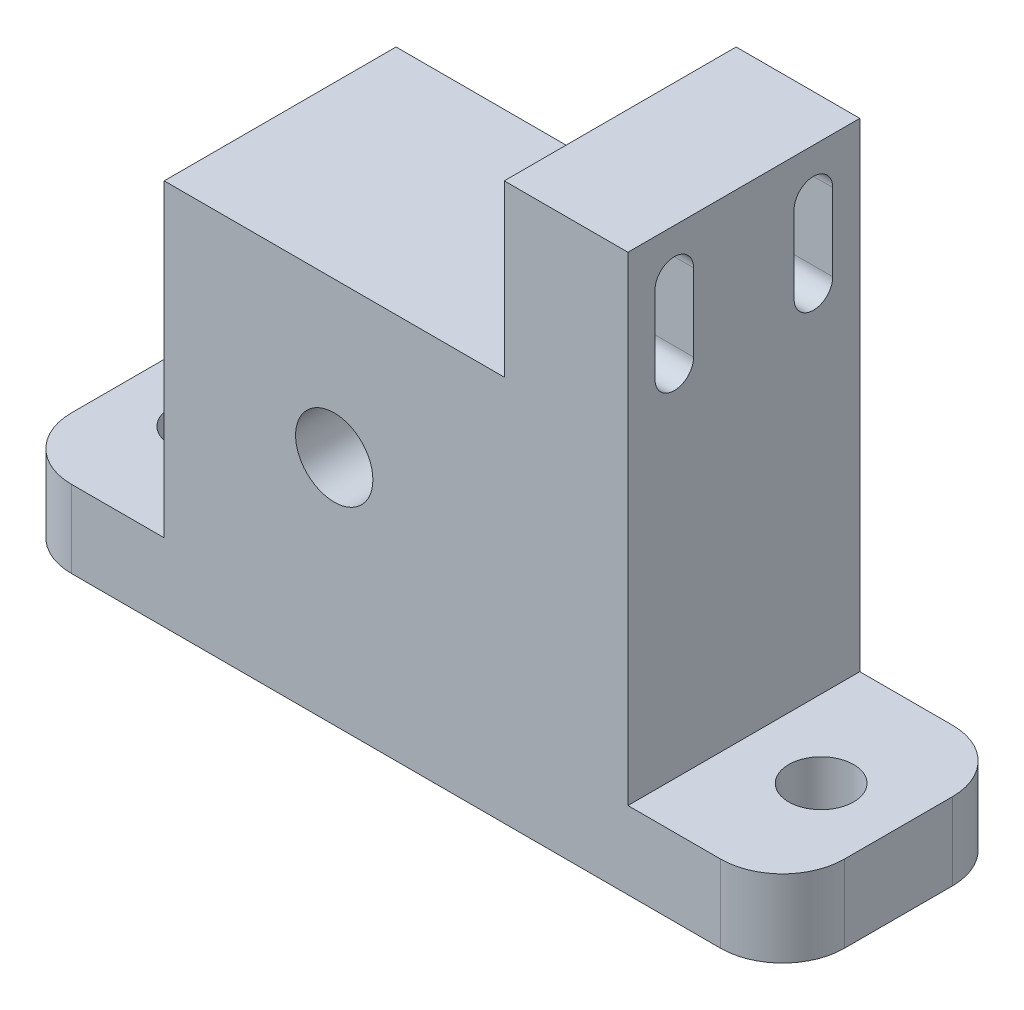
ISO-10303-21;
HEADER;
FILE_DESCRIPTION(('STEP AP214'),'2;1');
FILE_NAME('part.step','',(''),(''),'','','');
FILE_SCHEMA(('AUTOMOTIVE_DESIGN { 1 0 10303 214 1 1 1 1 }'));
ENDSEC;
DATA;
#1=APPLICATION_CONTEXT('core data for automotive mechanical design processes');
#2=APPLICATION_PROTOCOL_DEFINITION('international standard','automotive_design',2000,#1);
#3=PRODUCT_CONTEXT('',#1,'mechanical');
#4=PRODUCT('Part','Part','',(#3));
#5=PRODUCT_RELATED_PRODUCT_CATEGORY('part','',(#4));
#6=PRODUCT_DEFINITION_FORMATION('','',#4);
#7=PRODUCT_DEFINITION_CONTEXT('part definition',#1,'design');
#8=PRODUCT_DEFINITION('design','',#6,#7);
#9=PRODUCT_DEFINITION_SHAPE('','',#8);
#10=(LENGTH_UNIT() NAMED_UNIT(*) SI_UNIT(.MILLI.,.METRE.));
#11=(NAMED_UNIT(*) PLANE_ANGLE_UNIT() SI_UNIT($,.RADIAN.));
#12=(NAMED_UNIT(*) SI_UNIT($,.STERADIAN.) SOLID_ANGLE_UNIT());
#13=UNCERTAINTY_MEASURE_WITH_UNIT(LENGTH_MEASURE(1.E-05),#10,'distance_accuracy_value','');
#14=(GEOMETRIC_REPRESENTATION_CONTEXT(3) GLOBAL_UNCERTAINTY_ASSIGNED_CONTEXT((#13)) GLOBAL_UNIT_ASSIGNED_CONTEXT((#10,
#11,#12)) REPRESENTATION_CONTEXT('',''));
#15=CARTESIAN_POINT('',(0.,0.,0.));
#16=DIRECTION('',(0.,0.,1.));
#17=DIRECTION('',(1.,0.,0.));
#18=AXIS2_PLACEMENT_3D('',#15,#16,#17);
#19=CARTESIAN_POINT('',(15.,25.,-7.5));
#20=DIRECTION('',(-1.,0.,0.));
#21=DIRECTION('',(0.,0.,1.));
#22=AXIS2_PLACEMENT_3D('',#19,#20,#21);
#23=PLANE('',#22);
#24=DIRECTION('',(0.,-1.,0.));
#25=VECTOR('',#24,1.);
#26=CARTESIAN_POINT('',(15.,33.,5.75));
#27=LINE('',#26,#25);
#28=CARTESIAN_POINT('',(15.,33.,5.75));
#29=VERTEX_POINT('',#28);
#30=CARTESIAN_POINT('',(15.,28.,5.75));
#31=VERTEX_POINT('',#30);
#32=EDGE_CURVE('E209',#29,#31,#27,.T.);
#33=ORIENTED_EDGE('',*,*,#32,.F.);
#34=CARTESIAN_POINT('',(15.,33.,4.5));
#35=DIRECTION('',(-1.,0.,0.));
#36=DIRECTION('',(0.,0.,1.));
#37=AXIS2_PLACEMENT_3D('',#34,#35,#36);
#38=CIRCLE('',#37,1.25);
#39=CARTESIAN_POINT('',(15.,33.,3.25));
#40=VERTEX_POINT('',#39);
#41=EDGE_CURVE('E188',#40,#29,#38,.F.);
#42=ORIENTED_EDGE('',*,*,#41,.F.);
#43=DIRECTION('',(0.,1.,0.));
#44=VECTOR('',#43,1.);
#45=CARTESIAN_POINT('',(15.,33.,3.25));
#46=LINE('',#45,#44);
#47=CARTESIAN_POINT('',(15.,28.,3.25));
#48=VERTEX_POINT('',#47);
#49=EDGE_CURVE('E200',#48,#40,#46,.T.);
#50=ORIENTED_EDGE('',*,*,#49,.F.);
#51=CARTESIAN_POINT('',(15.,28.,4.5));
#52=DIRECTION('',(-1.,0.,0.));
#53=DIRECTION('',(0.,0.,1.));
#54=AXIS2_PLACEMENT_3D('',#51,#52,#53);
#55=CIRCLE('',#54,1.25);
#56=EDGE_CURVE('E213',#31,#48,#55,.F.);
#57=ORIENTED_EDGE('',*,*,#56,.F.);
#58=EDGE_LOOP('',(#33,#42,#50,#57));
#59=FACE_BOUND('',#58,.T.);
#60=DIRECTION('',(0.,-1.,0.));
#61=VECTOR('',#60,1.);
#62=CARTESIAN_POINT('',(15.,33.,-3.25));
#63=LINE('',#62,#61);
#64=CARTESIAN_POINT('',(15.,33.,-3.25));
#65=VERTEX_POINT('',#64);
#66=CARTESIAN_POINT('',(15.,28.,-3.25));
#67=VERTEX_POINT('',#66);
#68=EDGE_CURVE('E229',#65,#67,#63,.T.);
#69=ORIENTED_EDGE('',*,*,#68,.F.);
#70=CARTESIAN_POINT('',(15.,33.,-4.5));
#71=DIRECTION('',(-1.,0.,0.));
#72=DIRECTION('',(0.,0.,1.));
#73=AXIS2_PLACEMENT_3D('',#70,#71,#72);
#74=CIRCLE('',#73,1.25);
#75=CARTESIAN_POINT('',(15.,33.,-5.75));
#76=VERTEX_POINT('',#75);
#77=EDGE_CURVE('E233',#76,#65,#74,.F.);
#78=ORIENTED_EDGE('',*,*,#77,.F.);
#79=DIRECTION('',(0.,1.,0.));
#80=VECTOR('',#79,1.);
#81=CARTESIAN_POINT('',(15.,33.,-5.75));
#82=LINE('',#81,#80);
#83=CARTESIAN_POINT('',(15.,28.,-5.75));
#84=VERTEX_POINT('',#83);
#85=EDGE_CURVE('E250',#84,#76,#82,.T.);
#86=ORIENTED_EDGE('',*,*,#85,.F.);
#87=CARTESIAN_POINT('',(15.,28.,-4.5));
#88=DIRECTION('',(-1.,0.,0.));
#89=DIRECTION('',(0.,0.,1.));
#90=AXIS2_PLACEMENT_3D('',#87,#88,#89);
#91=CIRCLE('',#90,1.25);
#92=EDGE_CURVE('E227',#67,#84,#91,.F.);
#93=ORIENTED_EDGE('',*,*,#92,.F.);
#94=EDGE_LOOP('',(#69,#78,#86,#93));
#95=FACE_BOUND('',#94,.T.);
#96=DIRECTION('',(0.,-1.,0.));
#97=VECTOR('',#96,1.);
#98=CARTESIAN_POINT('',(15.,25.,7.5));
#99=LINE('',#98,#97);
#100=CARTESIAN_POINT('',(15.,36.,7.5));
#101=VERTEX_POINT('',#100);
#102=CARTESIAN_POINT('',(15.,5.,7.5));
#103=VERTEX_POINT('',#102);
#104=EDGE_CURVE('E291',#101,#103,#99,.T.);
#105=ORIENTED_EDGE('',*,*,#104,.T.);
#106=DIRECTION('',(0.,0.,-1.));
#107=VECTOR('',#106,1.);
#108=CARTESIAN_POINT('',(15.,5.,-7.5));
#109=LINE('',#108,#107);
#110=CARTESIAN_POINT('',(15.,5.,-7.5));
#111=VERTEX_POINT('',#110);
#112=EDGE_CURVE('E230',#103,#111,#109,.T.);
#113=ORIENTED_EDGE('',*,*,#112,.T.);
#114=DIRECTION('',(0.,-1.,0.));
#115=VECTOR('',#114,1.);
#116=CARTESIAN_POINT('',(15.,25.,-7.5));
#117=LINE('',#116,#115);
#118=CARTESIAN_POINT('',(15.,36.,-7.5));
#119=VERTEX_POINT('',#118);
#120=EDGE_CURVE('E304',#119,#111,#117,.T.);
#121=ORIENTED_EDGE('',*,*,#120,.F.);
#122=DIRECTION('',(0.,0.,-1.));
#123=VECTOR('',#122,1.);
#124=CARTESIAN_POINT('',(15.,36.,-7.5));
#125=LINE('',#124,#123);
#126=EDGE_CURVE('E265',#101,#119,#125,.T.);
#127=ORIENTED_EDGE('',*,*,#126,.F.);
#128=EDGE_LOOP('',(#105,#113,#121,#127));
#129=FACE_BOUND('',#128,.T.);
#130=ADVANCED_FACE('F35',(#59,#95,#129),#23,.F.);
#131=CARTESIAN_POINT('',(-15.,25.,-7.5));
#132=DIRECTION('',(0.,0.,1.));
#133=DIRECTION('',(1.,0.,0.));
#134=AXIS2_PLACEMENT_3D('',#131,#132,#133);
#135=PLANE('',#134);
#136=CARTESIAN_POINT('',(-4.,15.,-7.5));
#137=DIRECTION('',(0.,0.,1.));
#138=DIRECTION('',(1.,0.,0.));
#139=AXIS2_PLACEMENT_3D('',#136,#137,#138);
#140=CIRCLE('',#139,2.5);
#141=CARTESIAN_POINT('',(-1.5,15.,-7.5));
#142=VERTEX_POINT('',#141);
#143=EDGE_CURVE('E261',#142,#142,#140,.F.);
#144=ORIENTED_EDGE('',*,*,#143,.F.);
#145=EDGE_LOOP('',(#144));
#146=FACE_BOUND('',#145,.T.);
#147=DIRECTION('',(1.,0.,0.));
#148=VECTOR('',#147,1.);
#149=CARTESIAN_POINT('',(-25.,5.,-7.5));
#150=LINE('',#149,#148);
#151=CARTESIAN_POINT('',(21.,5.,-7.5));
#152=VERTEX_POINT('',#151);
#153=EDGE_CURVE('E409',#111,#152,#150,.T.);
#154=ORIENTED_EDGE('',*,*,#153,.T.);
#155=DIRECTION('',(0.,-1.,0.));
#156=VECTOR('',#155,1.);
#157=CARTESIAN_POINT('',(21.,0.,-7.5));
#158=LINE('',#157,#156);
#159=CARTESIAN_POINT('',(21.,0.,-7.5));
#160=VERTEX_POINT('',#159);
#161=EDGE_CURVE('E331',#152,#160,#158,.T.);
#162=ORIENTED_EDGE('',*,*,#161,.T.);
#163=DIRECTION('',(-1.,0.,0.));
#164=VECTOR('',#163,1.);
#165=CARTESIAN_POINT('',(-15.,0.,-7.5));
#166=LINE('',#165,#164);
#167=CARTESIAN_POINT('',(-21.,0.,-7.5));
#168=VERTEX_POINT('',#167);
#169=EDGE_CURVE('E283',#160,#168,#166,.T.);
#170=ORIENTED_EDGE('',*,*,#169,.T.);
#171=DIRECTION('',(0.,-1.,0.));
#172=VECTOR('',#171,1.);
#173=CARTESIAN_POINT('',(-21.,5.,-7.5));
#174=LINE('',#173,#172);
#175=CARTESIAN_POINT('',(-21.,5.,-7.5));
#176=VERTEX_POINT('',#175);
#177=EDGE_CURVE('E329',#168,#176,#174,.F.);
#178=ORIENTED_EDGE('',*,*,#177,.T.);
#179=CARTESIAN_POINT('',(-15.,5.,-7.5));
#180=VERTEX_POINT('',#179);
#181=EDGE_CURVE('E372',#176,#180,#150,.T.);
#182=ORIENTED_EDGE('',*,*,#181,.T.);
#183=DIRECTION('',(0.,-1.,0.));
#184=VECTOR('',#183,1.);
#185=CARTESIAN_POINT('',(-15.,25.,-7.5));
#186=LINE('',#185,#184);
#187=CARTESIAN_POINT('',(-15.,25.,-7.5));
#188=VERTEX_POINT('',#187);
#189=EDGE_CURVE('E301',#188,#180,#186,.T.);
#190=ORIENTED_EDGE('',*,*,#189,.F.);
#191=DIRECTION('',(-1.,0.,0.));
#192=VECTOR('',#191,1.);
#193=CARTESIAN_POINT('',(-15.,25.,-7.5));
#194=LINE('',#193,#192);
#195=CARTESIAN_POINT('',(7.,25.,-7.5));
#196=VERTEX_POINT('',#195);
#197=EDGE_CURVE('E284',#196,#188,#194,.T.);
#198=ORIENTED_EDGE('',*,*,#197,.F.);
#199=DIRECTION('',(0.,-1.,0.));
#200=VECTOR('',#199,1.);
#201=CARTESIAN_POINT('',(6.99999999999999,36.,-7.5));
#202=LINE('',#201,#200);
#203=CARTESIAN_POINT('',(6.99999999999999,36.,-7.5));
#204=VERTEX_POINT('',#203);
#205=EDGE_CURVE('E280',#204,#196,#202,.T.);
#206=ORIENTED_EDGE('',*,*,#205,.F.);
#207=DIRECTION('',(-1.,0.,0.));
#208=VECTOR('',#207,1.);
#209=CARTESIAN_POINT('',(15.,36.,-7.5));
#210=LINE('',#209,#208);
#211=EDGE_CURVE('E268',#119,#204,#210,.T.);
#212=ORIENTED_EDGE('',*,*,#211,.F.);
#213=ORIENTED_EDGE('',*,*,#120,.T.);
#214=EDGE_LOOP('',(#154,#162,#170,#178,#182,#190,#198,#206,#212,#213));
#215=FACE_BOUND('',#214,.T.);
#216=ADVANCED_FACE('F403',(#146,#215),#135,.F.);
#217=CARTESIAN_POINT('',(-15.,25.,-7.5));
#218=DIRECTION('',(1.,0.,0.));
#219=DIRECTION('',(0.,0.,-1.));
#220=AXIS2_PLACEMENT_3D('',#217,#218,#219);
#221=PLANE('',#220);
#222=ORIENTED_EDGE('',*,*,#189,.T.);
#223=DIRECTION('',(0.,0.,1.));
#224=VECTOR('',#223,1.);
#225=CARTESIAN_POINT('',(-15.,5.,-7.5));
#226=LINE('',#225,#224);
#227=CARTESIAN_POINT('',(-15.,5.,7.5));
#228=VERTEX_POINT('',#227);
#229=EDGE_CURVE('E370',#180,#228,#226,.T.);
#230=ORIENTED_EDGE('',*,*,#229,.T.);
#231=DIRECTION('',(0.,-1.,0.));
#232=VECTOR('',#231,1.);
#233=CARTESIAN_POINT('',(-15.,25.,7.5));
#234=LINE('',#233,#232);
#235=CARTESIAN_POINT('',(-15.,25.,7.5));
#236=VERTEX_POINT('',#235);
#237=EDGE_CURVE('E298',#236,#228,#234,.T.);
#238=ORIENTED_EDGE('',*,*,#237,.F.);
#239=DIRECTION('',(0.,0.,1.));
#240=VECTOR('',#239,1.);
#241=CARTESIAN_POINT('',(-15.,25.,-7.5));
#242=LINE('',#241,#240);
#243=EDGE_CURVE('E286',#188,#236,#242,.T.);
#244=ORIENTED_EDGE('',*,*,#243,.F.);
#245=EDGE_LOOP('',(#222,#230,#238,#244));
#246=FACE_BOUND('',#245,.T.);
#247=ADVANCED_FACE('F408',(#246),#221,.F.);
#248=CARTESIAN_POINT('',(-15.,25.,7.5));
#249=DIRECTION('',(0.,0.,-1.));
#250=DIRECTION('',(-1.,0.,0.));
#251=AXIS2_PLACEMENT_3D('',#248,#249,#250);
#252=PLANE('',#251);
#253=CARTESIAN_POINT('',(-4.,15.,7.5));
#254=DIRECTION('',(0.,0.,1.));
#255=DIRECTION('',(1.,0.,0.));
#256=AXIS2_PLACEMENT_3D('',#253,#254,#255);
#257=CIRCLE('',#256,2.5);
#258=CARTESIAN_POINT('',(-1.5,15.,7.5));
#259=VERTEX_POINT('',#258);
#260=EDGE_CURVE('E204',#259,#259,#257,.T.);
#261=ORIENTED_EDGE('',*,*,#260,.F.);
#262=EDGE_LOOP('',(#261));
#263=FACE_BOUND('',#262,.T.);
#264=DIRECTION('',(1.,0.,0.));
#265=VECTOR('',#264,1.);
#266=CARTESIAN_POINT('',(-15.,0.,7.5));
#267=LINE('',#266,#265);
#268=CARTESIAN_POINT('',(-21.,0.,7.5));
#269=VERTEX_POINT('',#268);
#270=CARTESIAN_POINT('',(21.,0.,7.5));
#271=VERTEX_POINT('',#270);
#272=EDGE_CURVE('E287',#269,#271,#267,.T.);
#273=ORIENTED_EDGE('',*,*,#272,.T.);
#274=DIRECTION('',(0.,-1.,0.));
#275=VECTOR('',#274,1.);
#276=CARTESIAN_POINT('',(21.,5.,7.5));
#277=LINE('',#276,#275);
#278=CARTESIAN_POINT('',(21.,5.,7.5));
#279=VERTEX_POINT('',#278);
#280=EDGE_CURVE('E323',#271,#279,#277,.F.);
#281=ORIENTED_EDGE('',*,*,#280,.T.);
#282=DIRECTION('',(-1.,0.,0.));
#283=VECTOR('',#282,1.);
#284=CARTESIAN_POINT('',(-25.,5.,7.5));
#285=LINE('',#284,#283);
#286=EDGE_CURVE('E351',#279,#103,#285,.T.);
#287=ORIENTED_EDGE('',*,*,#286,.T.);
#288=ORIENTED_EDGE('',*,*,#104,.F.);
#289=DIRECTION('',(1.,0.,0.));
#290=VECTOR('',#289,1.);
#291=CARTESIAN_POINT('',(15.,36.,7.5));
#292=LINE('',#291,#290);
#293=CARTESIAN_POINT('',(7.,36.,7.5));
#294=VERTEX_POINT('',#293);
#295=EDGE_CURVE('E272',#294,#101,#292,.T.);
#296=ORIENTED_EDGE('',*,*,#295,.F.);
#297=DIRECTION('',(0.,-1.,0.));
#298=VECTOR('',#297,1.);
#299=CARTESIAN_POINT('',(7.,36.,7.5));
#300=LINE('',#299,#298);
#301=CARTESIAN_POINT('',(7.,25.,7.5));
#302=VERTEX_POINT('',#301);
#303=EDGE_CURVE('E275',#294,#302,#300,.T.);
#304=ORIENTED_EDGE('',*,*,#303,.T.);
#305=DIRECTION('',(1.,0.,0.));
#306=VECTOR('',#305,1.);
#307=CARTESIAN_POINT('',(-15.,25.,7.5));
#308=LINE('',#307,#306);
#309=EDGE_CURVE('E289',#236,#302,#308,.T.);
#310=ORIENTED_EDGE('',*,*,#309,.F.);
#311=ORIENTED_EDGE('',*,*,#237,.T.);
#312=CARTESIAN_POINT('',(-21.,5.,7.5));
#313=VERTEX_POINT('',#312);
#314=EDGE_CURVE('E342',#228,#313,#285,.T.);
#315=ORIENTED_EDGE('',*,*,#314,.T.);
#316=DIRECTION('',(0.,-1.,0.));
#317=VECTOR('',#316,1.);
#318=CARTESIAN_POINT('',(-21.,0.,7.5));
#319=LINE('',#318,#317);
#320=EDGE_CURVE('E320',#313,#269,#319,.T.);
#321=ORIENTED_EDGE('',*,*,#320,.T.);
#322=EDGE_LOOP('',(#273,#281,#287,#288,#296,#304,#310,#311,#315,#321));
#323=FACE_BOUND('',#322,.T.);
#324=ADVANCED_FACE('F347',(#263,#323),#252,.F.);
#325=CARTESIAN_POINT('',(0.,25.,0.));
#326=DIRECTION('',(0.,1.,0.));
#327=DIRECTION('',(0.,0.,1.));
#328=AXIS2_PLACEMENT_3D('',#325,#326,#327);
#329=PLANE('',#328);
#330=DIRECTION('',(0.,0.,1.));
#331=VECTOR('',#330,1.);
#332=CARTESIAN_POINT('',(6.99999999999999,25.,-7.5));
#333=LINE('',#332,#331);
#334=EDGE_CURVE('E264',#196,#302,#333,.T.);
#335=ORIENTED_EDGE('',*,*,#334,.F.);
#336=ORIENTED_EDGE('',*,*,#197,.T.);
#337=ORIENTED_EDGE('',*,*,#243,.T.);
#338=ORIENTED_EDGE('',*,*,#309,.T.);
#339=EDGE_LOOP('',(#335,#336,#337,#338));
#340=FACE_BOUND('',#339,.T.);
#341=ADVANCED_FACE('F406',(#340),#329,.T.);
#342=CARTESIAN_POINT('',(0.,0.,0.));
#343=DIRECTION('',(0.,1.,0.));
#344=DIRECTION('',(0.,0.,1.));
#345=AXIS2_PLACEMENT_3D('',#342,#343,#344);
#346=PLANE('',#345);
#347=DIRECTION('',(0.,0.,1.));
#348=VECTOR('',#347,1.);
#349=CARTESIAN_POINT('',(25.,0.,-7.5));
#350=LINE('',#349,#348);
#351=CARTESIAN_POINT('',(25.,0.,-3.5));
#352=VERTEX_POINT('',#351);
#353=CARTESIAN_POINT('',(25.,0.,3.5));
#354=VERTEX_POINT('',#353);
#355=EDGE_CURVE('E362',#352,#354,#350,.T.);
#356=ORIENTED_EDGE('',*,*,#355,.T.);
#357=CARTESIAN_POINT('',(21.,0.,3.5));
#358=DIRECTION('',(0.,1.,0.));
#359=DIRECTION('',(0.,0.,1.));
#360=AXIS2_PLACEMENT_3D('',#357,#358,#359);
#361=CIRCLE('',#360,4.);
#362=EDGE_CURVE('E318',#354,#271,#361,.F.);
#363=ORIENTED_EDGE('',*,*,#362,.T.);
#364=ORIENTED_EDGE('',*,*,#272,.F.);
#365=CARTESIAN_POINT('',(-21.,0.,3.5));
#366=DIRECTION('',(0.,1.,0.));
#367=DIRECTION('',(0.,0.,1.));
#368=AXIS2_PLACEMENT_3D('',#365,#366,#367);
#369=CIRCLE('',#368,4.);
#370=CARTESIAN_POINT('',(-25.,0.,3.5));
#371=VERTEX_POINT('',#370);
#372=EDGE_CURVE('E312',#269,#371,#369,.F.);
#373=ORIENTED_EDGE('',*,*,#372,.T.);
#374=DIRECTION('',(0.,0.,-1.));
#375=VECTOR('',#374,1.);
#376=CARTESIAN_POINT('',(-25.,0.,-7.5));
#377=LINE('',#376,#375);
#378=CARTESIAN_POINT('',(-25.,0.,-3.5));
#379=VERTEX_POINT('',#378);
#380=EDGE_CURVE('E359',#371,#379,#377,.T.);
#381=ORIENTED_EDGE('',*,*,#380,.T.);
#382=CARTESIAN_POINT('',(-21.,0.,-3.5));
#383=DIRECTION('',(0.,1.,0.));
#384=DIRECTION('',(0.,0.,1.));
#385=AXIS2_PLACEMENT_3D('',#382,#383,#384);
#386=CIRCLE('',#385,4.);
#387=EDGE_CURVE('E314',#379,#168,#386,.F.);
#388=ORIENTED_EDGE('',*,*,#387,.T.);
#389=ORIENTED_EDGE('',*,*,#169,.F.);
#390=CARTESIAN_POINT('',(21.,0.,-3.5));
#391=DIRECTION('',(0.,1.,0.));
#392=DIRECTION('',(0.,0.,1.));
#393=AXIS2_PLACEMENT_3D('',#390,#391,#392);
#394=CIRCLE('',#393,4.);
#395=EDGE_CURVE('E316',#160,#352,#394,.F.);
#396=ORIENTED_EDGE('',*,*,#395,.T.);
#397=EDGE_LOOP('',(#356,#363,#364,#373,#381,#388,#389,#396));
#398=FACE_BOUND('',#397,.T.);
#399=CARTESIAN_POINT('',(-20.,0.,0.));
#400=DIRECTION('',(0.,-1.,0.));
#401=DIRECTION('',(0.,0.,-1.));
#402=AXIS2_PLACEMENT_3D('',#399,#400,#401);
#403=CIRCLE('',#402,2.1);
#404=CARTESIAN_POINT('',(-20.,0.,-2.1));
#405=VERTEX_POINT('',#404);
#406=EDGE_CURVE('E439',#405,#405,#403,.T.);
#407=ORIENTED_EDGE('',*,*,#406,.F.);
#408=EDGE_LOOP('',(#407));
#409=FACE_BOUND('',#408,.T.);
#410=CARTESIAN_POINT('',(20.,0.,0.));
#411=DIRECTION('',(0.,-1.,0.));
#412=DIRECTION('',(0.,0.,-1.));
#413=AXIS2_PLACEMENT_3D('',#410,#411,#412);
#414=CIRCLE('',#413,2.1);
#415=CARTESIAN_POINT('',(20.,0.,-2.1));
#416=VERTEX_POINT('',#415);
#417=EDGE_CURVE('E433',#416,#416,#414,.T.);
#418=ORIENTED_EDGE('',*,*,#417,.F.);
#419=EDGE_LOOP('',(#418));
#420=FACE_BOUND('',#419,.T.);
#421=ADVANCED_FACE('F357',(#398,#409,#420),#346,.F.);
#422=CARTESIAN_POINT('',(6.99999999999999,36.,-7.5));
#423=DIRECTION('',(1.,0.,0.));
#424=DIRECTION('',(0.,0.,-1.));
#425=AXIS2_PLACEMENT_3D('',#422,#423,#424);
#426=PLANE('',#425);
#427=DIRECTION('',(0.,-1.,0.));
#428=VECTOR('',#427,1.);
#429=CARTESIAN_POINT('',(6.99999999999999,33.,3.25));
#430=LINE('',#429,#428);
#431=CARTESIAN_POINT('',(7.,33.,3.25));
#432=VERTEX_POINT('',#431);
#433=CARTESIAN_POINT('',(6.99999999999999,28.,3.25));
#434=VERTEX_POINT('',#433);
#435=EDGE_CURVE('E211',#432,#434,#430,.T.);
#436=ORIENTED_EDGE('',*,*,#435,.F.);
#437=CARTESIAN_POINT('',(6.99999999999999,33.,4.5));
#438=DIRECTION('',(-1.,0.,0.));
#439=DIRECTION('',(0.,0.,1.));
#440=AXIS2_PLACEMENT_3D('',#437,#438,#439);
#441=CIRCLE('',#440,1.25);
#442=CARTESIAN_POINT('',(6.99999999999999,33.,5.75));
#443=VERTEX_POINT('',#442);
#444=EDGE_CURVE('E191',#443,#432,#441,.T.);
#445=ORIENTED_EDGE('',*,*,#444,.F.);
#446=DIRECTION('',(0.,1.,0.));
#447=VECTOR('',#446,1.);
#448=CARTESIAN_POINT('',(6.99999999999999,33.,5.75));
#449=LINE('',#448,#447);
#450=CARTESIAN_POINT('',(6.99999999999999,28.,5.75));
#451=VERTEX_POINT('',#450);
#452=EDGE_CURVE('E196',#451,#443,#449,.T.);
#453=ORIENTED_EDGE('',*,*,#452,.F.);
#454=CARTESIAN_POINT('',(6.99999999999999,28.,4.5));
#455=DIRECTION('',(-1.,0.,0.));
#456=DIRECTION('',(0.,0.,1.));
#457=AXIS2_PLACEMENT_3D('',#454,#455,#456);
#458=CIRCLE('',#457,1.25);
#459=EDGE_CURVE('E218',#434,#451,#458,.T.);
#460=ORIENTED_EDGE('',*,*,#459,.F.);
#461=EDGE_LOOP('',(#436,#445,#453,#460));
#462=FACE_BOUND('',#461,.T.);
#463=DIRECTION('',(0.,-1.,0.));
#464=VECTOR('',#463,1.);
#465=CARTESIAN_POINT('',(6.99999999999999,33.,-5.75));
#466=LINE('',#465,#464);
#467=CARTESIAN_POINT('',(6.99999999999999,33.,-5.75));
#468=VERTEX_POINT('',#467);
#469=CARTESIAN_POINT('',(6.99999999999999,28.,-5.75));
#470=VERTEX_POINT('',#469);
#471=EDGE_CURVE('E238',#468,#470,#466,.T.);
#472=ORIENTED_EDGE('',*,*,#471,.F.);
#473=CARTESIAN_POINT('',(6.99999999999999,33.,-4.5));
#474=DIRECTION('',(-1.,0.,0.));
#475=DIRECTION('',(0.,0.,1.));
#476=AXIS2_PLACEMENT_3D('',#473,#474,#475);
#477=CIRCLE('',#476,1.25);
#478=CARTESIAN_POINT('',(6.99999999999999,33.,-3.25));
#479=VERTEX_POINT('',#478);
#480=EDGE_CURVE('E236',#479,#468,#477,.T.);
#481=ORIENTED_EDGE('',*,*,#480,.F.);
#482=DIRECTION('',(0.,1.,0.));
#483=VECTOR('',#482,1.);
#484=CARTESIAN_POINT('',(6.99999999999999,33.,-3.25));
#485=LINE('',#484,#483);
#486=CARTESIAN_POINT('',(6.99999999999999,28.,-3.25));
#487=VERTEX_POINT('',#486);
#488=EDGE_CURVE('E244',#487,#479,#485,.T.);
#489=ORIENTED_EDGE('',*,*,#488,.F.);
#490=CARTESIAN_POINT('',(6.99999999999999,28.,-4.5));
#491=DIRECTION('',(-1.,0.,0.));
#492=DIRECTION('',(0.,0.,1.));
#493=AXIS2_PLACEMENT_3D('',#490,#491,#492);
#494=CIRCLE('',#493,1.25);
#495=EDGE_CURVE('E241',#470,#487,#494,.T.);
#496=ORIENTED_EDGE('',*,*,#495,.F.);
#497=EDGE_LOOP('',(#472,#481,#489,#496));
#498=FACE_BOUND('',#497,.T.);
#499=ORIENTED_EDGE('',*,*,#334,.T.);
#500=ORIENTED_EDGE('',*,*,#303,.F.);
#501=DIRECTION('',(0.,0.,1.));
#502=VECTOR('',#501,1.);
#503=CARTESIAN_POINT('',(6.99999999999999,36.,-7.5));
#504=LINE('',#503,#502);
#505=EDGE_CURVE('E270',#204,#294,#504,.T.);
#506=ORIENTED_EDGE('',*,*,#505,.F.);
#507=ORIENTED_EDGE('',*,*,#205,.T.);
#508=EDGE_LOOP('',(#499,#500,#506,#507));
#509=FACE_BOUND('',#508,.T.);
#510=ADVANCED_FACE('F380',(#462,#498,#509),#426,.F.);
#511=CARTESIAN_POINT('',(0.,36.,0.));
#512=DIRECTION('',(0.,-1.,0.));
#513=DIRECTION('',(0.,0.,-1.));
#514=AXIS2_PLACEMENT_3D('',#511,#512,#513);
#515=PLANE('',#514);
#516=ORIENTED_EDGE('',*,*,#126,.T.);
#517=ORIENTED_EDGE('',*,*,#211,.T.);
#518=ORIENTED_EDGE('',*,*,#505,.T.);
#519=ORIENTED_EDGE('',*,*,#295,.T.);
#520=EDGE_LOOP('',(#516,#517,#518,#519));
#521=FACE_BOUND('',#520,.T.);
#522=ADVANCED_FACE('F383',(#521),#515,.F.);
#523=CARTESIAN_POINT('',(-4.,15.,-7.501));
#524=DIRECTION('',(0.,0.,1.));
#525=DIRECTION('',(1.,0.,0.));
#526=AXIS2_PLACEMENT_3D('',#523,#524,#525);
#527=CYLINDRICAL_SURFACE('',#526,2.5);
#528=ORIENTED_EDGE('',*,*,#260,.T.);
#529=EDGE_LOOP('',(#528));
#530=FACE_BOUND('',#529,.T.);
#531=ORIENTED_EDGE('',*,*,#143,.T.);
#532=EDGE_LOOP('',(#531));
#533=FACE_BOUND('',#532,.T.);
#534=ADVANCED_FACE('F650',(#530,#533),#527,.F.);
#535=CARTESIAN_POINT('',(15.001,33.,-4.5));
#536=DIRECTION('',(-1.,0.,0.));
#537=DIRECTION('',(0.,0.,1.));
#538=AXIS2_PLACEMENT_3D('',#535,#536,#537);
#539=CYLINDRICAL_SURFACE('',#538,1.25);
#540=ORIENTED_EDGE('',*,*,#77,.T.);
#541=DIRECTION('',(-1.,0.,0.));
#542=VECTOR('',#541,1.);
#543=CARTESIAN_POINT('',(15.001,33.,-3.25));
#544=LINE('',#543,#542);
#545=EDGE_CURVE('E248',#65,#479,#544,.T.);
#546=ORIENTED_EDGE('',*,*,#545,.T.);
#547=ORIENTED_EDGE('',*,*,#480,.T.);
#548=DIRECTION('',(-1.,0.,0.));
#549=VECTOR('',#548,1.);
#550=CARTESIAN_POINT('',(15.001,33.,-5.75));
#551=LINE('',#550,#549);
#552=EDGE_CURVE('E247',#76,#468,#551,.T.);
#553=ORIENTED_EDGE('',*,*,#552,.F.);
#554=EDGE_LOOP('',(#540,#546,#547,#553));
#555=FACE_BOUND('',#554,.T.);
#556=ADVANCED_FACE('F640',(#555),#539,.F.);
#557=CARTESIAN_POINT('',(15.001,33.,-3.25));
#558=DIRECTION('',(0.,0.,1.));
#559=DIRECTION('',(1.,0.,0.));
#560=AXIS2_PLACEMENT_3D('',#557,#558,#559);
#561=PLANE('',#560);
#562=ORIENTED_EDGE('',*,*,#68,.T.);
#563=DIRECTION('',(-1.,0.,0.));
#564=VECTOR('',#563,1.);
#565=CARTESIAN_POINT('',(15.001,28.,-3.25));
#566=LINE('',#565,#564);
#567=EDGE_CURVE('E251',#67,#487,#566,.T.);
#568=ORIENTED_EDGE('',*,*,#567,.T.);
#569=ORIENTED_EDGE('',*,*,#488,.T.);
#570=ORIENTED_EDGE('',*,*,#545,.F.);
#571=EDGE_LOOP('',(#562,#568,#569,#570));
#572=FACE_BOUND('',#571,.T.);
#573=ADVANCED_FACE('F630',(#572),#561,.F.);
#574=CARTESIAN_POINT('',(15.001,28.,-4.5));
#575=DIRECTION('',(-1.,0.,0.));
#576=DIRECTION('',(0.,0.,1.));
#577=AXIS2_PLACEMENT_3D('',#574,#575,#576);
#578=CYLINDRICAL_SURFACE('',#577,1.25);
#579=ORIENTED_EDGE('',*,*,#92,.T.);
#580=DIRECTION('',(-1.,0.,0.));
#581=VECTOR('',#580,1.);
#582=CARTESIAN_POINT('',(15.001,28.,-5.75));
#583=LINE('',#582,#581);
#584=EDGE_CURVE('E253',#84,#470,#583,.T.);
#585=ORIENTED_EDGE('',*,*,#584,.T.);
#586=ORIENTED_EDGE('',*,*,#495,.T.);
#587=ORIENTED_EDGE('',*,*,#567,.F.);
#588=EDGE_LOOP('',(#579,#585,#586,#587));
#589=FACE_BOUND('',#588,.T.);
#590=ADVANCED_FACE('F620',(#589),#578,.F.);
#591=CARTESIAN_POINT('',(15.001,33.,-5.75));
#592=DIRECTION('',(0.,0.,-1.));
#593=DIRECTION('',(-1.,0.,0.));
#594=AXIS2_PLACEMENT_3D('',#591,#592,#593);
#595=PLANE('',#594);
#596=ORIENTED_EDGE('',*,*,#85,.T.);
#597=ORIENTED_EDGE('',*,*,#552,.T.);
#598=ORIENTED_EDGE('',*,*,#471,.T.);
#599=ORIENTED_EDGE('',*,*,#584,.F.);
#600=EDGE_LOOP('',(#596,#597,#598,#599));
#601=FACE_BOUND('',#600,.T.);
#602=ADVANCED_FACE('F611',(#601),#595,.F.);
#603=CARTESIAN_POINT('',(15.001,33.,4.5));
#604=DIRECTION('',(-1.,0.,0.));
#605=DIRECTION('',(0.,0.,1.));
#606=AXIS2_PLACEMENT_3D('',#603,#604,#605);
#607=CYLINDRICAL_SURFACE('',#606,1.25);
#608=ORIENTED_EDGE('',*,*,#41,.T.);
#609=DIRECTION('',(-1.,0.,0.));
#610=VECTOR('',#609,1.);
#611=CARTESIAN_POINT('',(15.001,33.,5.75));
#612=LINE('',#611,#610);
#613=EDGE_CURVE('E205',#29,#443,#612,.T.);
#614=ORIENTED_EDGE('',*,*,#613,.T.);
#615=ORIENTED_EDGE('',*,*,#444,.T.);
#616=DIRECTION('',(-1.,0.,0.));
#617=VECTOR('',#616,1.);
#618=CARTESIAN_POINT('',(15.001,33.,3.25));
#619=LINE('',#618,#617);
#620=EDGE_CURVE('E184',#40,#432,#619,.T.);
#621=ORIENTED_EDGE('',*,*,#620,.F.);
#622=EDGE_LOOP('',(#608,#614,#615,#621));
#623=FACE_BOUND('',#622,.T.);
#624=ADVANCED_FACE('F186',(#623),#607,.F.);
#625=CARTESIAN_POINT('',(15.001,33.,5.75));
#626=DIRECTION('',(0.,0.,1.));
#627=DIRECTION('',(1.,0.,0.));
#628=AXIS2_PLACEMENT_3D('',#625,#626,#627);
#629=PLANE('',#628);
#630=ORIENTED_EDGE('',*,*,#32,.T.);
#631=DIRECTION('',(-1.,0.,0.));
#632=VECTOR('',#631,1.);
#633=CARTESIAN_POINT('',(15.001,28.,5.75));
#634=LINE('',#633,#632);
#635=EDGE_CURVE('E224',#31,#451,#634,.T.);
#636=ORIENTED_EDGE('',*,*,#635,.T.);
#637=ORIENTED_EDGE('',*,*,#452,.T.);
#638=ORIENTED_EDGE('',*,*,#613,.F.);
#639=EDGE_LOOP('',(#630,#636,#637,#638));
#640=FACE_BOUND('',#639,.T.);
#641=ADVANCED_FACE('F378',(#640),#629,.F.);
#642=CARTESIAN_POINT('',(15.001,28.,4.5));
#643=DIRECTION('',(-1.,0.,0.));
#644=DIRECTION('',(0.,0.,1.));
#645=AXIS2_PLACEMENT_3D('',#642,#643,#644);
#646=CYLINDRICAL_SURFACE('',#645,1.25);
#647=ORIENTED_EDGE('',*,*,#56,.T.);
#648=DIRECTION('',(-1.,0.,0.));
#649=VECTOR('',#648,1.);
#650=CARTESIAN_POINT('',(15.001,28.,3.25));
#651=LINE('',#650,#649);
#652=EDGE_CURVE('E195',#48,#434,#651,.T.);
#653=ORIENTED_EDGE('',*,*,#652,.T.);
#654=ORIENTED_EDGE('',*,*,#459,.T.);
#655=ORIENTED_EDGE('',*,*,#635,.F.);
#656=EDGE_LOOP('',(#647,#653,#654,#655));
#657=FACE_BOUND('',#656,.T.);
#658=ADVANCED_FACE('F374',(#657),#646,.F.);
#659=CARTESIAN_POINT('',(15.001,33.,3.25));
#660=DIRECTION('',(0.,0.,-1.));
#661=DIRECTION('',(-1.,0.,0.));
#662=AXIS2_PLACEMENT_3D('',#659,#660,#661);
#663=PLANE('',#662);
#664=ORIENTED_EDGE('',*,*,#49,.T.);
#665=ORIENTED_EDGE('',*,*,#620,.T.);
#666=ORIENTED_EDGE('',*,*,#435,.T.);
#667=ORIENTED_EDGE('',*,*,#652,.F.);
#668=EDGE_LOOP('',(#664,#665,#666,#667));
#669=FACE_BOUND('',#668,.T.);
#670=ADVANCED_FACE('F201',(#669),#663,.F.);
#671=CARTESIAN_POINT('',(-25.,5.,-7.5));
#672=DIRECTION('',(-1.,0.,0.));
#673=DIRECTION('',(0.,0.,1.));
#674=AXIS2_PLACEMENT_3D('',#671,#672,#673);
#675=PLANE('',#674);
#676=DIRECTION('',(0.,0.,-1.));
#677=VECTOR('',#676,1.);
#678=CARTESIAN_POINT('',(-25.,5.,-7.5));
#679=LINE('',#678,#677);
#680=CARTESIAN_POINT('',(-25.,5.,3.5));
#681=VERTEX_POINT('',#680);
#682=CARTESIAN_POINT('',(-25.,5.,-3.5));
#683=VERTEX_POINT('',#682);
#684=EDGE_CURVE('E343',#681,#683,#679,.T.);
#685=ORIENTED_EDGE('',*,*,#684,.T.);
#686=DIRECTION('',(0.,-1.,0.));
#687=VECTOR('',#686,1.);
#688=CARTESIAN_POINT('',(-25.,0.,-3.5));
#689=LINE('',#688,#687);
#690=EDGE_CURVE('E335',#683,#379,#689,.T.);
#691=ORIENTED_EDGE('',*,*,#690,.T.);
#692=ORIENTED_EDGE('',*,*,#380,.F.);
#693=DIRECTION('',(0.,-1.,0.));
#694=VECTOR('',#693,1.);
#695=CARTESIAN_POINT('',(-25.,5.,3.5));
#696=LINE('',#695,#694);
#697=EDGE_CURVE('E55',#371,#681,#696,.F.);
#698=ORIENTED_EDGE('',*,*,#697,.T.);
#699=EDGE_LOOP('',(#685,#691,#692,#698));
#700=FACE_BOUND('',#699,.T.);
#701=ADVANCED_FACE('F360',(#700),#675,.T.);
#702=CARTESIAN_POINT('',(-20.,5.,0.));
#703=DIRECTION('',(0.,-1.,0.));
#704=DIRECTION('',(0.,0.,-1.));
#705=AXIS2_PLACEMENT_3D('',#702,#703,#704);
#706=CYLINDRICAL_SURFACE('',#705,2.1);
#707=CARTESIAN_POINT('',(-20.,5.,0.));
#708=DIRECTION('',(0.,-1.,0.));
#709=DIRECTION('',(0.,0.,-1.));
#710=AXIS2_PLACEMENT_3D('',#707,#708,#709);
#711=CIRCLE('',#710,2.1);
#712=CARTESIAN_POINT('',(-20.,5.,-2.1));
#713=VERTEX_POINT('',#712);
#714=EDGE_CURVE('E436',#713,#713,#711,.T.);
#715=ORIENTED_EDGE('',*,*,#714,.F.);
#716=EDGE_LOOP('',(#715));
#717=FACE_BOUND('',#716,.T.);
#718=ORIENTED_EDGE('',*,*,#406,.T.);
#719=EDGE_LOOP('',(#718));
#720=FACE_BOUND('',#719,.T.);
#721=ADVANCED_FACE('F446',(#717,#720),#706,.F.);
#722=CARTESIAN_POINT('',(0.,5.,0.));
#723=DIRECTION('',(0.,1.,0.));
#724=DIRECTION('',(0.,0.,1.));
#725=AXIS2_PLACEMENT_3D('',#722,#723,#724);
#726=PLANE('',#725);
#727=ORIENTED_EDGE('',*,*,#714,.T.);
#728=EDGE_LOOP('',(#727));
#729=FACE_BOUND('',#728,.T.);
#730=ORIENTED_EDGE('',*,*,#181,.F.);
#731=CARTESIAN_POINT('',(-21.,5.,-3.5));
#732=DIRECTION('',(0.,1.,0.));
#733=DIRECTION('',(0.,0.,1.));
#734=AXIS2_PLACEMENT_3D('',#731,#732,#733);
#735=CIRCLE('',#734,4.);
#736=EDGE_CURVE('E11',#176,#683,#735,.T.);
#737=ORIENTED_EDGE('',*,*,#736,.T.);
#738=ORIENTED_EDGE('',*,*,#684,.F.);
#739=CARTESIAN_POINT('',(-21.,5.,3.5));
#740=DIRECTION('',(0.,1.,0.));
#741=DIRECTION('',(0.,0.,1.));
#742=AXIS2_PLACEMENT_3D('',#739,#740,#741);
#743=CIRCLE('',#742,4.);
#744=EDGE_CURVE('E43',#681,#313,#743,.T.);
#745=ORIENTED_EDGE('',*,*,#744,.T.);
#746=ORIENTED_EDGE('',*,*,#314,.F.);
#747=ORIENTED_EDGE('',*,*,#229,.F.);
#748=EDGE_LOOP('',(#730,#737,#738,#745,#746,#747));
#749=FACE_BOUND('',#748,.T.);
#750=ADVANCED_FACE('F340',(#729,#749),#726,.T.);
#751=CARTESIAN_POINT('',(20.,5.,0.));
#752=DIRECTION('',(0.,-1.,0.));
#753=DIRECTION('',(0.,0.,-1.));
#754=AXIS2_PLACEMENT_3D('',#751,#752,#753);
#755=CIRCLE('',#754,2.1);
#756=CARTESIAN_POINT('',(20.,5.,-2.1));
#757=VERTEX_POINT('',#756);
#758=EDGE_CURVE('E366',#757,#757,#755,.T.);
#759=ORIENTED_EDGE('',*,*,#758,.T.);
#760=EDGE_LOOP('',(#759));
#761=FACE_BOUND('',#760,.T.);
#762=ORIENTED_EDGE('',*,*,#286,.F.);
#763=CARTESIAN_POINT('',(21.,5.,3.5));
#764=DIRECTION('',(0.,1.,0.));
#765=DIRECTION('',(0.,0.,1.));
#766=AXIS2_PLACEMENT_3D('',#763,#764,#765);
#767=CIRCLE('',#766,4.);
#768=CARTESIAN_POINT('',(25.,5.,3.5));
#769=VERTEX_POINT('',#768);
#770=EDGE_CURVE('E327',#279,#769,#767,.T.);
#771=ORIENTED_EDGE('',*,*,#770,.T.);
#772=DIRECTION('',(0.,0.,1.));
#773=VECTOR('',#772,1.);
#774=CARTESIAN_POINT('',(25.,5.,-7.5));
#775=LINE('',#774,#773);
#776=CARTESIAN_POINT('',(25.,5.,-3.5));
#777=VERTEX_POINT('',#776);
#778=EDGE_CURVE('E352',#777,#769,#775,.T.);
#779=ORIENTED_EDGE('',*,*,#778,.F.);
#780=CARTESIAN_POINT('',(21.,5.,-3.5));
#781=DIRECTION('',(0.,1.,0.));
#782=DIRECTION('',(0.,0.,1.));
#783=AXIS2_PLACEMENT_3D('',#780,#781,#782);
#784=CIRCLE('',#783,4.);
#785=EDGE_CURVE('E325',#777,#152,#784,.T.);
#786=ORIENTED_EDGE('',*,*,#785,.T.);
#787=ORIENTED_EDGE('',*,*,#153,.F.);
#788=ORIENTED_EDGE('',*,*,#112,.F.);
#789=EDGE_LOOP('',(#762,#771,#779,#786,#787,#788));
#790=FACE_BOUND('',#789,.T.);
#791=ADVANCED_FACE('F430',(#761,#790),#726,.T.);
#792=CARTESIAN_POINT('',(25.,5.,-7.5));
#793=DIRECTION('',(1.,0.,0.));
#794=DIRECTION('',(0.,0.,-1.));
#795=AXIS2_PLACEMENT_3D('',#792,#793,#794);
#796=PLANE('',#795);
#797=ORIENTED_EDGE('',*,*,#778,.T.);
#798=DIRECTION('',(0.,-1.,0.));
#799=VECTOR('',#798,1.);
#800=CARTESIAN_POINT('',(25.,0.,3.5));
#801=LINE('',#800,#799);
#802=EDGE_CURVE('E309',#769,#354,#801,.T.);
#803=ORIENTED_EDGE('',*,*,#802,.T.);
#804=ORIENTED_EDGE('',*,*,#355,.F.);
#805=DIRECTION('',(0.,-1.,0.));
#806=VECTOR('',#805,1.);
#807=CARTESIAN_POINT('',(25.,5.,-3.5));
#808=LINE('',#807,#806);
#809=EDGE_CURVE('E307',#352,#777,#808,.F.);
#810=ORIENTED_EDGE('',*,*,#809,.T.);
#811=EDGE_LOOP('',(#797,#803,#804,#810));
#812=FACE_BOUND('',#811,.T.);
#813=ADVANCED_FACE('F421',(#812),#796,.T.);
#814=CARTESIAN_POINT('',(20.,5.,0.));
#815=DIRECTION('',(0.,-1.,0.));
#816=DIRECTION('',(0.,0.,-1.));
#817=AXIS2_PLACEMENT_3D('',#814,#815,#816);
#818=CYLINDRICAL_SURFACE('',#817,2.1);
#819=ORIENTED_EDGE('',*,*,#758,.F.);
#820=EDGE_LOOP('',(#819));
#821=FACE_BOUND('',#820,.T.);
#822=ORIENTED_EDGE('',*,*,#417,.T.);
#823=EDGE_LOOP('',(#822));
#824=FACE_BOUND('',#823,.T.);
#825=ADVANCED_FACE('F456',(#821,#824),#818,.F.);
#826=CARTESIAN_POINT('',(21.,5.,3.5));
#827=DIRECTION('',(0.,1.,0.));
#828=DIRECTION('',(0.,0.,1.));
#829=AXIS2_PLACEMENT_3D('',#826,#827,#828);
#830=CYLINDRICAL_SURFACE('',#829,4.);
#831=ORIENTED_EDGE('',*,*,#770,.F.);
#832=ORIENTED_EDGE('',*,*,#280,.F.);
#833=ORIENTED_EDGE('',*,*,#362,.F.);
#834=ORIENTED_EDGE('',*,*,#802,.F.);
#835=EDGE_LOOP('',(#831,#832,#833,#834));
#836=FACE_BOUND('',#835,.T.);
#837=ADVANCED_FACE('F426',(#836),#830,.T.);
#838=CARTESIAN_POINT('',(21.,25.,-3.5));
#839=DIRECTION('',(0.,1.,0.));
#840=DIRECTION('',(0.,0.,1.));
#841=AXIS2_PLACEMENT_3D('',#838,#839,#840);
#842=CYLINDRICAL_SURFACE('',#841,4.);
#843=ORIENTED_EDGE('',*,*,#785,.F.);
#844=ORIENTED_EDGE('',*,*,#809,.F.);
#845=ORIENTED_EDGE('',*,*,#395,.F.);
#846=ORIENTED_EDGE('',*,*,#161,.F.);
#847=EDGE_LOOP('',(#843,#844,#845,#846));
#848=FACE_BOUND('',#847,.T.);
#849=ADVANCED_FACE('F417',(#848),#842,.T.);
#850=CARTESIAN_POINT('',(-21.,5.,-3.5));
#851=DIRECTION('',(0.,1.,0.));
#852=DIRECTION('',(0.,0.,1.));
#853=AXIS2_PLACEMENT_3D('',#850,#851,#852);
#854=CYLINDRICAL_SURFACE('',#853,4.);
#855=ORIENTED_EDGE('',*,*,#736,.F.);
#856=ORIENTED_EDGE('',*,*,#177,.F.);
#857=ORIENTED_EDGE('',*,*,#387,.F.);
#858=ORIENTED_EDGE('',*,*,#690,.F.);
#859=EDGE_LOOP('',(#855,#856,#857,#858));
#860=FACE_BOUND('',#859,.T.);
#861=ADVANCED_FACE('F412',(#860),#854,.T.);
#862=CARTESIAN_POINT('',(-21.,25.,3.5));
#863=DIRECTION('',(0.,1.,0.));
#864=DIRECTION('',(0.,0.,1.));
#865=AXIS2_PLACEMENT_3D('',#862,#863,#864);
#866=CYLINDRICAL_SURFACE('',#865,4.);
#867=ORIENTED_EDGE('',*,*,#744,.F.);
#868=ORIENTED_EDGE('',*,*,#697,.F.);
#869=ORIENTED_EDGE('',*,*,#372,.F.);
#870=ORIENTED_EDGE('',*,*,#320,.F.);
#871=EDGE_LOOP('',(#867,#868,#869,#870));
#872=FACE_BOUND('',#871,.T.);
#873=ADVANCED_FACE('F37',(#872),#866,.T.);
#874=CLOSED_SHELL('',(#130,#216,#247,#324,#341,#421,#510,#522,#534,#556,#573,#590,#602,#624,
#641,#658,#670,#701,#721,#750,#791,#813,#825,#837,#849,#861,#873));
#875=MANIFOLD_SOLID_BREP('B2',#874);
#876=ADVANCED_BREP_SHAPE_REPRESENTATION('',(#18,#875),#14);
#877=SHAPE_DEFINITION_REPRESENTATION(#9,#876);
ENDSEC;
END-ISO-10303-21;
